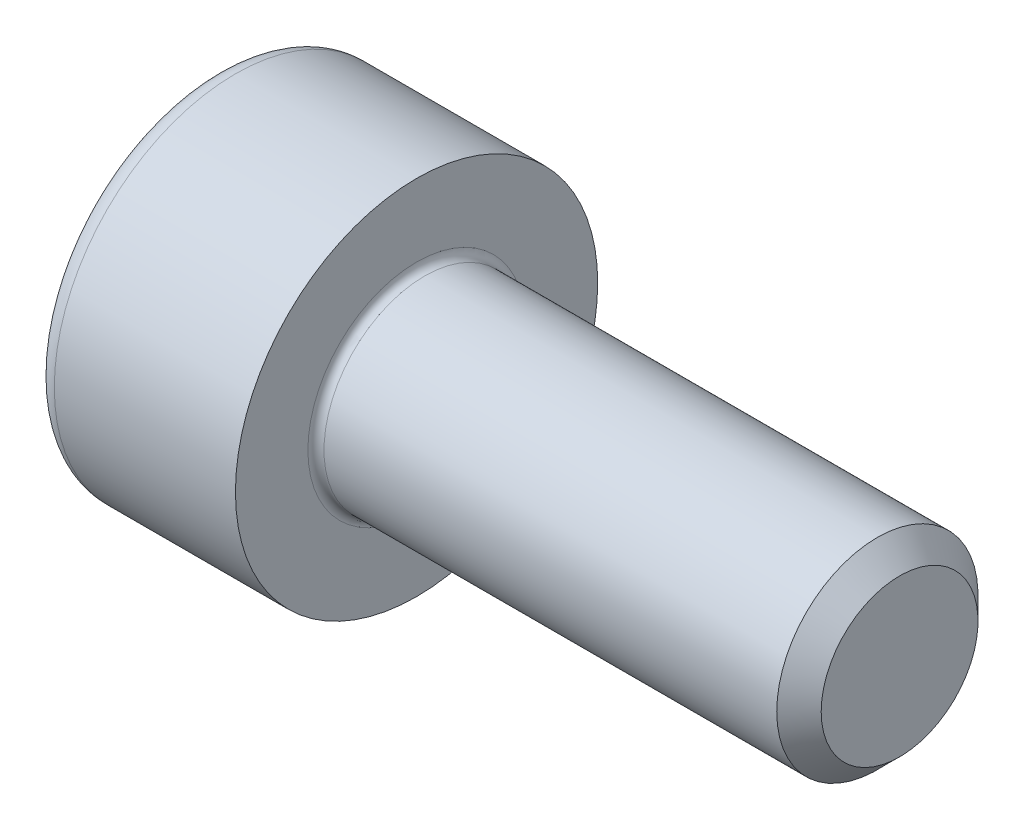
ISO-10303-21;
HEADER;
FILE_DESCRIPTION(('STEP AP214'),'2;1');
FILE_NAME('part.step','',(''),(''),'','','');
FILE_SCHEMA(('AUTOMOTIVE_DESIGN { 1 0 10303 214 1 1 1 1 }'));
ENDSEC;
DATA;
#1=APPLICATION_CONTEXT('core data for automotive mechanical design processes');
#2=APPLICATION_PROTOCOL_DEFINITION('international standard','automotive_design',2000,#1);
#3=PRODUCT_CONTEXT('',#1,'mechanical');
#4=PRODUCT('Part','Part','',(#3));
#5=PRODUCT_RELATED_PRODUCT_CATEGORY('part','',(#4));
#6=PRODUCT_DEFINITION_FORMATION('','',#4);
#7=PRODUCT_DEFINITION_CONTEXT('part definition',#1,'design');
#8=PRODUCT_DEFINITION('design','',#6,#7);
#9=PRODUCT_DEFINITION_SHAPE('','',#8);
#10=(LENGTH_UNIT() NAMED_UNIT(*) SI_UNIT(.MILLI.,.METRE.));
#11=(NAMED_UNIT(*) PLANE_ANGLE_UNIT() SI_UNIT($,.RADIAN.));
#12=(NAMED_UNIT(*) SI_UNIT($,.STERADIAN.) SOLID_ANGLE_UNIT());
#13=UNCERTAINTY_MEASURE_WITH_UNIT(LENGTH_MEASURE(1.E-05),#10,'distance_accuracy_value','');
#14=(GEOMETRIC_REPRESENTATION_CONTEXT(3) GLOBAL_UNCERTAINTY_ASSIGNED_CONTEXT((#13)) GLOBAL_UNIT_ASSIGNED_CONTEXT((#10,
#11,#12)) REPRESENTATION_CONTEXT('',''));
#15=CARTESIAN_POINT('',(0.,0.,0.));
#16=DIRECTION('',(0.,0.,1.));
#17=DIRECTION('',(1.,0.,0.));
#18=AXIS2_PLACEMENT_3D('',#15,#16,#17);
#19=CARTESIAN_POINT('',(-1.40399999992269,0.,0.));
#20=DIRECTION('',(-1.,0.,0.));
#21=DIRECTION('',(0.,0.,1.));
#22=AXIS2_PLACEMENT_3D('',#19,#20,#21);
#23=CONICAL_SURFACE('',#22,1.16162874138581,1.04719755102068);
#24=CARTESIAN_POINT('',(-0.733333333300834,-1.13686837721616E-10,0.));
#25=VERTEX_POINT('',#24);
#26=VERTEX_LOOP('',#25);
#27=FACE_BOUND('',#26,.T.);
#28=CARTESIAN_POINT('',(-1.40000000004636,1.,0.577350269176239));
#29=CARTESIAN_POINT('',(-1.38534777260353,1.,0.526608173631617));
#30=CARTESIAN_POINT('',(-1.3720223385847,1.,0.475428073039767));
#31=CARTESIAN_POINT('',(-1.34876319372511,1.,0.372181722648916));
#32=CARTESIAN_POINT('',(-1.33883771019004,1.,0.320113638959241));
#33=CARTESIAN_POINT('',(-1.3233879794885,1.,0.216622725240409));
#34=CARTESIAN_POINT('',(-1.31776089381223,1.,0.165215814154328));
#35=CARTESIAN_POINT('',(-1.31104458407795,1.,0.0621602316776418));
#36=CARTESIAN_POINT('',(-1.30994979700044,0.999999999999999,0.0105119346090386));
#37=CARTESIAN_POINT('',(-1.31223314509385,0.999999999999999,-0.085987367761552));
#38=CARTESIAN_POINT('',(-1.31505064262633,0.999999999999999,-0.130852853570059));
#39=CARTESIAN_POINT('',(-1.32397865038136,0.999999999999999,-0.220291541181625));
#40=CARTESIAN_POINT('',(-1.33009220740897,0.999999999999999,-0.264864433871037));
#41=CARTESIAN_POINT('',(-1.34537491669912,0.999999999999999,-0.354487373613871));
#42=CARTESIAN_POINT('',(-1.35460882114213,0.999999999999999,-0.399526083396908));
#43=CARTESIAN_POINT('',(-1.37556588045909,0.999999999999999,-0.488931944893052));
#44=CARTESIAN_POINT('',(-1.38728411441893,0.999999999999999,-0.533300241115023));
#45=CARTESIAN_POINT('',(-1.40000000004636,0.999999999999999,-0.577350269176243));
#46=B_SPLINE_CURVE_WITH_KNOTS('',3,(#28,#29,#30,#31,#32,#33,#34,#35,#36,#37,#38,#39,#40,#41,#42,
#43,#44,#45),.UNSPECIFIED.,.F.,.F.,(4,2,2,2,2,2,2,2,4),(0.,0.158508005788217,0.317396908533512,
0.472353803103194,0.627120444482222,0.761853891336563,0.896712096905205,1.0345608112415,
1.17213898674362),.UNSPECIFIED.);
#47=CARTESIAN_POINT('',(-1.40000000004636,0.999999999994205,0.577350269186277));
#48=VERTEX_POINT('',#47);
#49=CARTESIAN_POINT('',(-1.40000000004829,0.999999999999999,-0.577350269182935));
#50=VERTEX_POINT('',#49);
#51=EDGE_CURVE('E21',#48,#50,#46,.T.);
#52=ORIENTED_EDGE('',*,*,#51,.T.);
#53=CARTESIAN_POINT('',(-1.40000000004636,0.999999999988407,-0.577350269196318));
#54=CARTESIAN_POINT('',(-1.38534777260353,0.956056056205507,-0.60272131696863));
#55=CARTESIAN_POINT('',(-1.3720223385847,0.911732788924722,-0.628311367264555));
#56=CARTESIAN_POINT('',(-1.34876319372511,0.822318826638216,-0.67993454245998));
#57=CARTESIAN_POINT('',(-1.33883771019004,0.777226543436584,-0.705968584304817));
#58=CARTESIAN_POINT('',(-1.3233879794885,0.687600783095211,-0.757714041164234));
#59=CARTESIAN_POINT('',(-1.31776089381223,0.643081092164577,-0.783417496707274));
#60=CARTESIAN_POINT('',(-1.31104458407795,0.553832339737964,-0.834945287945617));
#61=CARTESIAN_POINT('',(-1.30994979700044,0.509103602414349,-0.860769436479919));
#62=CARTESIAN_POINT('',(-1.31223314509385,0.425532755113941,-0.909019087665214));
#63=CARTESIAN_POINT('',(-1.31505064262633,0.386678104650645,-0.931451830569467));
#64=CARTESIAN_POINT('',(-1.32397865038136,0.309221929097888,-0.97617117437525));
#65=CARTESIAN_POINT('',(-1.33009220740897,0.2706206717087,-0.998457620719956));
#66=CARTESIAN_POINT('',(-1.34537491669912,0.193004929129563,-1.04326909059137));
#67=CARTESIAN_POINT('',(-1.35460882114213,0.154000262303778,-1.06578844548289));
#68=CARTESIAN_POINT('',(-1.37556588045909,0.0765725150008851,-1.11049137623096));
#69=CARTESIAN_POINT('',(-1.38728411441893,0.0381484433500253,-1.13267552434195));
#70=CARTESIAN_POINT('',(-1.40000000004636,1.1590841575672E-11,-1.15470053837256));
#71=B_SPLINE_CURVE_WITH_KNOTS('',3,(#53,#54,#55,#56,#57,#58,#59,#60,#61,#62,#63,#64,#65,#66,#67,
#68,#69,#70),.UNSPECIFIED.,.F.,.F.,(4,2,2,2,2,2,2,2,4),(0.,0.158508005788217,0.317396908533512,
0.472353803103194,0.627120444482222,0.761853891336563,0.896712096905205,1.03456081124149,
1.17213898674362),.UNSPECIFIED.);
#72=CARTESIAN_POINT('',(-1.40000000004636,0.,-1.15470053837256));
#73=VERTEX_POINT('',#72);
#74=EDGE_CURVE('E81',#50,#73,#71,.T.);
#75=ORIENTED_EDGE('',*,*,#74,.T.);
#76=CARTESIAN_POINT('',(-1.40000000004636,-1.15903822349684E-11,-1.15470053837256));
#77=CARTESIAN_POINT('',(-1.38534777260353,-0.0439439437944907,-1.12932949060025));
#78=CARTESIAN_POINT('',(-1.3720223385847,-0.0882672110752756,-1.10373944030432));
#79=CARTESIAN_POINT('',(-1.34876319372511,-0.177681173361782,-1.0521162651089));
#80=CARTESIAN_POINT('',(-1.33883771019004,-0.222773456563414,-1.02608222326406));
#81=CARTESIAN_POINT('',(-1.3233879794885,-0.312399216904787,-0.974336766404643));
#82=CARTESIAN_POINT('',(-1.31776089381223,-0.356918907835421,-0.948633310861603));
#83=CARTESIAN_POINT('',(-1.31104458407795,-0.446167660262033,-0.897105519623259));
#84=CARTESIAN_POINT('',(-1.30994979700044,-0.490896397585649,-0.871281371088958));
#85=CARTESIAN_POINT('',(-1.31223314509385,-0.574467244886056,-0.823031719903663));
#86=CARTESIAN_POINT('',(-1.31505064262633,-0.613321895349353,-0.800598976999409));
#87=CARTESIAN_POINT('',(-1.32397865038136,-0.69077807090211,-0.755879633193626));
#88=CARTESIAN_POINT('',(-1.33009220740896,-0.729379328291299,-0.73359318684892));
#89=CARTESIAN_POINT('',(-1.34537491669912,-0.806995070870435,-0.688781716977503));
#90=CARTESIAN_POINT('',(-1.35460882114213,-0.845999737696221,-0.666262362085984));
#91=CARTESIAN_POINT('',(-1.37556588045909,-0.923427484999114,-0.621559431337912));
#92=CARTESIAN_POINT('',(-1.38728411441893,-0.961851556649974,-0.599375283226926));
#93=CARTESIAN_POINT('',(-1.40000000004636,-0.999999999988409,-0.577350269196316));
#94=B_SPLINE_CURVE_WITH_KNOTS('',3,(#76,#77,#78,#79,#80,#81,#82,#83,#84,#85,#86,#87,#88,#89,#90,
#91,#92,#93),.UNSPECIFIED.,.F.,.F.,(4,2,2,2,2,2,2,2,4),(0.,0.158508005788217,0.317396908533512,
0.472353803103194,0.627120444482222,0.761853891336564,0.896712096905206,1.0345608112415,
1.17213898674362),.UNSPECIFIED.);
#95=CARTESIAN_POINT('',(-1.40000000004636,-0.999999999994204,-0.577350269186278));
#96=VERTEX_POINT('',#95);
#97=EDGE_CURVE('E106',#73,#96,#94,.T.);
#98=ORIENTED_EDGE('',*,*,#97,.T.);
#99=CARTESIAN_POINT('',(-1.40000000004636,-1.,-0.577350269176241));
#100=CARTESIAN_POINT('',(-1.38534777260353,-1.,-0.526608173631618));
#101=CARTESIAN_POINT('',(-1.3720223385847,-1.,-0.475428073039768));
#102=CARTESIAN_POINT('',(-1.34876319372511,-1.,-0.372181722648918));
#103=CARTESIAN_POINT('',(-1.33883771019004,-1.,-0.320113638959243));
#104=CARTESIAN_POINT('',(-1.3233879794885,-1.,-0.21662272524041));
#105=CARTESIAN_POINT('',(-1.31776089381223,-1.,-0.165215814154329));
#106=CARTESIAN_POINT('',(-1.31104458407795,-1.,-0.0621602316776431));
#107=CARTESIAN_POINT('',(-1.30994979700045,-1.,-0.0105119346090399));
#108=CARTESIAN_POINT('',(-1.31223314509385,-1.,0.0859873677615507));
#109=CARTESIAN_POINT('',(-1.31505064262633,-1.,0.130852853570057));
#110=CARTESIAN_POINT('',(-1.32397865038136,-1.,0.220291541181623));
#111=CARTESIAN_POINT('',(-1.33009220740897,-1.,0.264864433871035));
#112=CARTESIAN_POINT('',(-1.34537491669912,-1.,0.35448737361387));
#113=CARTESIAN_POINT('',(-1.35460882114213,-1.,0.399526083396907));
#114=CARTESIAN_POINT('',(-1.37556588045909,-1.,0.488931944893051));
#115=CARTESIAN_POINT('',(-1.38728411441893,-1.,0.533300241115022));
#116=CARTESIAN_POINT('',(-1.40000000004636,-1.,0.577350269176242));
#117=B_SPLINE_CURVE_WITH_KNOTS('',3,(#99,#100,#101,#102,#103,#104,#105,#106,#107,#108,#109,#110,
#111,#112,#113,#114,#115,#116),.UNSPECIFIED.,.F.,.F.,(4,2,2,2,2,2,2,2,4),(0.,0.158508005788217,
0.317396908533512,0.472353803103194,0.627120444482222,0.761853891336564,0.896712096905206,
1.0345608112415,1.17213898674362),.UNSPECIFIED.);
#118=CARTESIAN_POINT('',(-1.40000000004636,-0.999999999994205,0.57735026918628));
#119=VERTEX_POINT('',#118);
#120=EDGE_CURVE('E130',#96,#119,#117,.T.);
#121=ORIENTED_EDGE('',*,*,#120,.T.);
#122=CARTESIAN_POINT('',(-1.40000000004636,-0.999999999988409,0.577350269196318));
#123=CARTESIAN_POINT('',(-1.38534777260353,-0.956056056205509,0.602721316968629));
#124=CARTESIAN_POINT('',(-1.3720223385847,-0.911732788924724,0.628311367264554));
#125=CARTESIAN_POINT('',(-1.34876319372512,-0.822318826638218,0.67993454245998));
#126=CARTESIAN_POINT('',(-1.33883771019004,-0.777226543436585,0.705968584304817));
#127=CARTESIAN_POINT('',(-1.3233879794885,-0.687600783095212,0.757714041164233));
#128=CARTESIAN_POINT('',(-1.31776089381223,-0.643081092164578,0.783417496707274));
#129=CARTESIAN_POINT('',(-1.31104458407795,-0.553832339737966,0.834945287945617));
#130=CARTESIAN_POINT('',(-1.30994979700045,-0.50910360241435,0.860769436479919));
#131=CARTESIAN_POINT('',(-1.31223314509385,-0.425532755113943,0.909019087665214));
#132=CARTESIAN_POINT('',(-1.31505064262633,-0.386678104650646,0.931451830569467));
#133=CARTESIAN_POINT('',(-1.32397865038136,-0.309221929097889,0.97617117437525));
#134=CARTESIAN_POINT('',(-1.33009220740897,-0.270620671708701,0.998457620719956));
#135=CARTESIAN_POINT('',(-1.34537491669912,-0.193004929129564,1.04326909059137));
#136=CARTESIAN_POINT('',(-1.35460882114213,-0.154000262303779,1.06578844548289));
#137=CARTESIAN_POINT('',(-1.37556588045909,-0.0765725150008856,1.11049137623096));
#138=CARTESIAN_POINT('',(-1.38728411441893,-0.0381484433500257,1.13267552434195));
#139=CARTESIAN_POINT('',(-1.40000000004636,-1.15914119388896E-11,1.15470053837256));
#140=B_SPLINE_CURVE_WITH_KNOTS('',3,(#122,#123,#124,#125,#126,#127,#128,#129,#130,#131,#132,
#133,#134,#135,#136,#137,#138,#139),.UNSPECIFIED.,.F.,.F.,(4,2,2,2,2,2,2,2,4),(0.,
0.158508005788217,0.317396908533513,0.472353803103195,0.627120444482223,0.761853891336564,
0.896712096905206,1.0345608112415,1.17213898674362),.UNSPECIFIED.);
#141=CARTESIAN_POINT('',(-1.40000000004636,0.,1.15470053837256));
#142=VERTEX_POINT('',#141);
#143=EDGE_CURVE('E138',#119,#142,#140,.T.);
#144=ORIENTED_EDGE('',*,*,#143,.T.);
#145=CARTESIAN_POINT('',(-1.40000000004636,1.15900007348579E-11,1.15470053837256));
#146=CARTESIAN_POINT('',(-1.38534777260353,0.0439439437944902,1.12932949060025));
#147=CARTESIAN_POINT('',(-1.3720223385847,0.0882672110752751,1.10373944030432));
#148=CARTESIAN_POINT('',(-1.34876319372511,0.177681173361781,1.0521162651089));
#149=CARTESIAN_POINT('',(-1.33883771019004,0.222773456563413,1.02608222326406));
#150=CARTESIAN_POINT('',(-1.3233879794885,0.312399216904786,0.974336766404643));
#151=CARTESIAN_POINT('',(-1.31776089381223,0.35691890783542,0.948633310861602));
#152=CARTESIAN_POINT('',(-1.31104458407795,0.446167660262032,0.897105519623259));
#153=CARTESIAN_POINT('',(-1.30994979700044,0.490896397585648,0.871281371088958));
#154=CARTESIAN_POINT('',(-1.31223314509385,0.574467244886055,0.823031719903662));
#155=CARTESIAN_POINT('',(-1.31505064262633,0.613321895349353,0.800598976999409));
#156=CARTESIAN_POINT('',(-1.32397865038136,0.69077807090211,0.755879633193625));
#157=CARTESIAN_POINT('',(-1.33009220740896,0.729379328291298,0.733593186848919));
#158=CARTESIAN_POINT('',(-1.34537491669912,0.806995070870435,0.688781716977502));
#159=CARTESIAN_POINT('',(-1.35460882114213,0.845999737696221,0.666262362085983));
#160=CARTESIAN_POINT('',(-1.37556588045909,0.923427484999114,0.621559431337911));
#161=CARTESIAN_POINT('',(-1.38728411441893,0.961851556649975,0.599375283226925));
#162=CARTESIAN_POINT('',(-1.40000000004636,0.999999999988409,0.577350269196314));
#163=B_SPLINE_CURVE_WITH_KNOTS('',3,(#145,#146,#147,#148,#149,#150,#151,#152,#153,#154,#155,
#156,#157,#158,#159,#160,#161,#162),.UNSPECIFIED.,.F.,.F.,(4,2,2,2,2,2,2,2,4),(0.,
0.158508005788217,0.317396908533512,0.472353803103194,0.627120444482222,0.761853891336564,
0.896712096905206,1.0345608112415,1.17213898674362),.UNSPECIFIED.);
#164=EDGE_CURVE('E83',#142,#48,#163,.T.);
#165=ORIENTED_EDGE('',*,*,#164,.T.);
#166=EDGE_LOOP('',(#52,#75,#98,#121,#144,#165));
#167=FACE_BOUND('',#166,.T.);
#168=ADVANCED_FACE('F17',(#27,#167),#23,.F.);
#169=CARTESIAN_POINT('',(-2.5,1.,0.577350269189624));
#170=DIRECTION('',(0.,1.,0.));
#171=DIRECTION('',(0.,0.,1.));
#172=AXIS2_PLACEMENT_3D('',#169,#170,#171);
#173=PLANE('',#172);
#174=DIRECTION('',(1.,0.,0.));
#175=VECTOR('',#174,1.);
#176=CARTESIAN_POINT('',(-2.5,1.,0.577350269189623));
#177=LINE('',#176,#175);
#178=CARTESIAN_POINT('',(-2.5,0.999999999999999,0.577350269189624));
#179=VERTEX_POINT('',#178);
#180=EDGE_CURVE('E85',#48,#179,#177,.F.);
#181=ORIENTED_EDGE('',*,*,#180,.T.);
#182=DIRECTION('',(0.,0.,1.));
#183=VECTOR('',#182,1.);
#184=CARTESIAN_POINT('',(-2.5,0.999999999999999,0.));
#185=LINE('',#184,#183);
#186=CARTESIAN_POINT('',(-2.5,0.999999999999999,-0.577350269189626));
#187=VERTEX_POINT('',#186);
#188=EDGE_CURVE('E90',#187,#179,#185,.T.);
#189=ORIENTED_EDGE('',*,*,#188,.F.);
#190=DIRECTION('',(1.,0.,0.));
#191=VECTOR('',#190,1.);
#192=CARTESIAN_POINT('',(-2.5,0.999999999999999,-0.577350269189626));
#193=LINE('',#192,#191);
#194=EDGE_CURVE('E88',#187,#50,#193,.T.);
#195=ORIENTED_EDGE('',*,*,#194,.T.);
#196=ORIENTED_EDGE('',*,*,#51,.F.);
#197=EDGE_LOOP('',(#181,#189,#195,#196));
#198=FACE_BOUND('',#197,.T.);
#199=ADVANCED_FACE('F77',(#198),#173,.F.);
#200=CARTESIAN_POINT('',(-2.5,0.,1.15470053837925));
#201=DIRECTION('',(0.,0.500000000000001,0.866025403784438));
#202=DIRECTION('',(0.,-0.866025403784438,0.500000000000001));
#203=AXIS2_PLACEMENT_3D('',#200,#201,#202);
#204=PLANE('',#203);
#205=DIRECTION('',(1.,0.,0.));
#206=VECTOR('',#205,1.);
#207=CARTESIAN_POINT('',(-2.5,0.,1.15470053837925));
#208=LINE('',#207,#206);
#209=CARTESIAN_POINT('',(-2.5,0.,1.15470053837925));
#210=VERTEX_POINT('',#209);
#211=EDGE_CURVE('E142',#142,#210,#208,.F.);
#212=ORIENTED_EDGE('',*,*,#211,.T.);
#213=DIRECTION('',(0.,-0.866025403784439,0.5));
#214=VECTOR('',#213,1.);
#215=CARTESIAN_POINT('',(-2.5,1.,0.577350269189624));
#216=LINE('',#215,#214);
#217=EDGE_CURVE('E96',#179,#210,#216,.T.);
#218=ORIENTED_EDGE('',*,*,#217,.F.);
#219=ORIENTED_EDGE('',*,*,#180,.F.);
#220=ORIENTED_EDGE('',*,*,#164,.F.);
#221=EDGE_LOOP('',(#212,#218,#219,#220));
#222=FACE_BOUND('',#221,.T.);
#223=ADVANCED_FACE('F146',(#222),#204,.F.);
#224=CARTESIAN_POINT('',(-2.5,-1.,0.577350269189626));
#225=DIRECTION('',(0.,-0.5,0.866025403784439));
#226=DIRECTION('',(0.,-0.866025403784439,-0.5));
#227=AXIS2_PLACEMENT_3D('',#224,#225,#226);
#228=PLANE('',#227);
#229=DIRECTION('',(1.,0.,0.));
#230=VECTOR('',#229,1.);
#231=CARTESIAN_POINT('',(-2.5,-1.,0.577350269189626));
#232=LINE('',#231,#230);
#233=CARTESIAN_POINT('',(-2.5,-1.,0.577350269189626));
#234=VERTEX_POINT('',#233);
#235=EDGE_CURVE('E137',#119,#234,#232,.F.);
#236=ORIENTED_EDGE('',*,*,#235,.T.);
#237=DIRECTION('',(0.,-0.866025403784439,-0.499999999999999));
#238=VECTOR('',#237,1.);
#239=CARTESIAN_POINT('',(-2.5,0.,1.15470053837925));
#240=LINE('',#239,#238);
#241=EDGE_CURVE('E265',#210,#234,#240,.T.);
#242=ORIENTED_EDGE('',*,*,#241,.F.);
#243=ORIENTED_EDGE('',*,*,#211,.F.);
#244=ORIENTED_EDGE('',*,*,#143,.F.);
#245=EDGE_LOOP('',(#236,#242,#243,#244));
#246=FACE_BOUND('',#245,.T.);
#247=ADVANCED_FACE('F126',(#246),#228,.F.);
#248=CARTESIAN_POINT('',(-2.5,-1.,-0.577350269189625));
#249=DIRECTION('',(0.,-1.,0.));
#250=DIRECTION('',(1.,0.,0.));
#251=AXIS2_PLACEMENT_3D('',#248,#249,#250);
#252=PLANE('',#251);
#253=DIRECTION('',(1.,0.,0.));
#254=VECTOR('',#253,1.);
#255=CARTESIAN_POINT('',(-2.5,-1.,-0.577350269189624));
#256=LINE('',#255,#254);
#257=CARTESIAN_POINT('',(-2.5,-1.,-0.577350269189624));
#258=VERTEX_POINT('',#257);
#259=EDGE_CURVE('E136',#96,#258,#256,.F.);
#260=ORIENTED_EDGE('',*,*,#259,.T.);
#261=DIRECTION('',(0.,0.,1.));
#262=VECTOR('',#261,1.);
#263=CARTESIAN_POINT('',(-2.5,-1.,0.));
#264=LINE('',#263,#262);
#265=EDGE_CURVE('E260',#234,#258,#264,.F.);
#266=ORIENTED_EDGE('',*,*,#265,.F.);
#267=ORIENTED_EDGE('',*,*,#235,.F.);
#268=ORIENTED_EDGE('',*,*,#120,.F.);
#269=EDGE_LOOP('',(#260,#266,#267,#268));
#270=FACE_BOUND('',#269,.T.);
#271=ADVANCED_FACE('F122',(#270),#252,.F.);
#272=CARTESIAN_POINT('',(-2.5,0.,-1.15470053837925));
#273=DIRECTION('',(0.,-0.5,-0.866025403784438));
#274=DIRECTION('',(0.,0.866025403784438,-0.5));
#275=AXIS2_PLACEMENT_3D('',#272,#273,#274);
#276=PLANE('',#275);
#277=DIRECTION('',(1.,0.,0.));
#278=VECTOR('',#277,1.);
#279=CARTESIAN_POINT('',(-2.5,0.,-1.15470053837925));
#280=LINE('',#279,#278);
#281=CARTESIAN_POINT('',(-2.5,0.,-1.15470053837925));
#282=VERTEX_POINT('',#281);
#283=EDGE_CURVE('E39',#73,#282,#280,.F.);
#284=ORIENTED_EDGE('',*,*,#283,.T.);
#285=DIRECTION('',(0.,0.866025403784439,-0.5));
#286=VECTOR('',#285,1.);
#287=CARTESIAN_POINT('',(-2.5,-1.,-0.577350269189625));
#288=LINE('',#287,#286);
#289=EDGE_CURVE('E255',#258,#282,#288,.T.);
#290=ORIENTED_EDGE('',*,*,#289,.F.);
#291=ORIENTED_EDGE('',*,*,#259,.F.);
#292=ORIENTED_EDGE('',*,*,#97,.F.);
#293=EDGE_LOOP('',(#284,#290,#291,#292));
#294=FACE_BOUND('',#293,.T.);
#295=ADVANCED_FACE('F116',(#294),#276,.F.);
#296=CARTESIAN_POINT('',(-2.5,0.999999999999999,-0.577350269189626));
#297=DIRECTION('',(0.,0.5,-0.866025403784439));
#298=DIRECTION('',(0.,0.866025403784439,0.5));
#299=AXIS2_PLACEMENT_3D('',#296,#297,#298);
#300=PLANE('',#299);
#301=ORIENTED_EDGE('',*,*,#194,.F.);
#302=DIRECTION('',(0.,0.866025403784439,0.499999999999999));
#303=VECTOR('',#302,1.);
#304=CARTESIAN_POINT('',(-2.5,0.,-1.15470053837925));
#305=LINE('',#304,#303);
#306=EDGE_CURVE('E253',#282,#187,#305,.T.);
#307=ORIENTED_EDGE('',*,*,#306,.F.);
#308=ORIENTED_EDGE('',*,*,#283,.F.);
#309=ORIENTED_EDGE('',*,*,#74,.F.);
#310=EDGE_LOOP('',(#301,#307,#308,#309));
#311=FACE_BOUND('',#310,.T.);
#312=ADVANCED_FACE('F94',(#311),#300,.F.);
#313=CARTESIAN_POINT('',(-2.5,1.70235026918963,0.));
#314=DIRECTION('',(-1.,0.,0.));
#315=DIRECTION('',(0.,-1.,0.));
#316=AXIS2_PLACEMENT_3D('',#313,#314,#315);
#317=PLANE('',#316);
#318=ORIENTED_EDGE('',*,*,#289,.T.);
#319=ORIENTED_EDGE('',*,*,#306,.T.);
#320=ORIENTED_EDGE('',*,*,#188,.T.);
#321=ORIENTED_EDGE('',*,*,#217,.T.);
#322=ORIENTED_EDGE('',*,*,#241,.T.);
#323=ORIENTED_EDGE('',*,*,#265,.T.);
#324=EDGE_LOOP('',(#318,#319,#320,#321,#322,#323));
#325=FACE_BOUND('',#324,.T.);
#326=CARTESIAN_POINT('',(-2.5,0.,0.));
#327=DIRECTION('',(1.,0.,0.));
#328=DIRECTION('',(0.,1.,0.));
#329=AXIS2_PLACEMENT_3D('',#326,#327,#328);
#330=CIRCLE('',#329,2.);
#331=CARTESIAN_POINT('',(-2.5,2.,0.));
#332=VERTEX_POINT('',#331);
#333=EDGE_CURVE('E216',#332,#332,#330,.T.);
#334=ORIENTED_EDGE('',*,*,#333,.F.);
#335=EDGE_LOOP('',(#334));
#336=FACE_BOUND('',#335,.T.);
#337=ADVANCED_FACE('F115',(#325,#336),#317,.T.);
#338=CARTESIAN_POINT('',(-2.25,0.,0.));
#339=DIRECTION('',(1.,0.,0.));
#340=DIRECTION('',(0.,0.,-1.));
#341=AXIS2_PLACEMENT_3D('',#338,#339,#340);
#342=TOROIDAL_SURFACE('',#341,2.,0.25);
#343=CARTESIAN_POINT('',(-2.25,0.,0.));
#344=DIRECTION('',(1.,0.,0.));
#345=DIRECTION('',(0.,1.,0.));
#346=AXIS2_PLACEMENT_3D('',#343,#344,#345);
#347=CIRCLE('',#346,2.25);
#348=CARTESIAN_POINT('',(-2.25,2.25,0.));
#349=VERTEX_POINT('',#348);
#350=EDGE_CURVE('E280',#349,#349,#347,.T.);
#351=ORIENTED_EDGE('',*,*,#350,.F.);
#352=EDGE_LOOP('',(#351));
#353=FACE_BOUND('',#352,.T.);
#354=ORIENTED_EDGE('',*,*,#333,.T.);
#355=EDGE_LOOP('',(#354));
#356=FACE_BOUND('',#355,.T.);
#357=ADVANCED_FACE('F200',(#353,#356),#342,.T.);
#358=CARTESIAN_POINT('',(-1.25,0.,0.));
#359=DIRECTION('',(1.,0.,0.));
#360=DIRECTION('',(0.,1.,0.));
#361=AXIS2_PLACEMENT_3D('',#358,#359,#360);
#362=CYLINDRICAL_SURFACE('',#361,2.25);
#363=ORIENTED_EDGE('',*,*,#350,.T.);
#364=EDGE_LOOP('',(#363));
#365=FACE_BOUND('',#364,.T.);
#366=CARTESIAN_POINT('',(0.,0.,0.));
#367=DIRECTION('',(1.,0.,0.));
#368=DIRECTION('',(0.,1.,0.));
#369=AXIS2_PLACEMENT_3D('',#366,#367,#368);
#370=CIRCLE('',#369,2.25);
#371=CARTESIAN_POINT('',(0.,2.25,0.));
#372=VERTEX_POINT('',#371);
#373=EDGE_CURVE('E104',#372,#372,#370,.T.);
#374=ORIENTED_EDGE('',*,*,#373,.F.);
#375=EDGE_LOOP('',(#374));
#376=FACE_BOUND('',#375,.T.);
#377=ADVANCED_FACE('F197',(#365,#376),#362,.T.);
#378=CARTESIAN_POINT('',(6.00000000000001,0.624999999999999,0.));
#379=DIRECTION('',(1.,0.,0.));
#380=DIRECTION('',(0.,1.,0.));
#381=AXIS2_PLACEMENT_3D('',#378,#379,#380);
#382=PLANE('',#381);
#383=CARTESIAN_POINT('',(5.99999999997181,0.,0.));
#384=DIRECTION('',(-1.,0.,0.));
#385=DIRECTION('',(0.,0.,1.));
#386=AXIS2_PLACEMENT_3D('',#383,#384,#385);
#387=CIRCLE('',#386,0.973947499971928);
#388=CARTESIAN_POINT('',(5.99999999997181,0.,0.973947499971928));
#389=VERTEX_POINT('',#388);
#390=EDGE_CURVE('E275',#389,#389,#387,.T.);
#391=ORIENTED_EDGE('',*,*,#390,.F.);
#392=EDGE_LOOP('',(#391));
#393=FACE_BOUND('',#392,.T.);
#394=ADVANCED_FACE('F194',(#393),#382,.T.);
#395=CARTESIAN_POINT('',(0.,1.75,0.));
#396=DIRECTION('',(1.,0.,0.));
#397=DIRECTION('',(0.,1.,0.));
#398=AXIS2_PLACEMENT_3D('',#395,#396,#397);
#399=PLANE('',#398);
#400=CARTESIAN_POINT('',(0.,0.,0.));
#401=DIRECTION('',(1.,0.,0.));
#402=DIRECTION('',(0.,1.,0.));
#403=AXIS2_PLACEMENT_3D('',#400,#401,#402);
#404=CIRCLE('',#403,1.35);
#405=CARTESIAN_POINT('',(0.,1.35,0.));
#406=VERTEX_POINT('',#405);
#407=EDGE_CURVE('E181',#406,#406,#404,.F.);
#408=ORIENTED_EDGE('',*,*,#407,.T.);
#409=EDGE_LOOP('',(#408));
#410=FACE_BOUND('',#409,.T.);
#411=ORIENTED_EDGE('',*,*,#373,.T.);
#412=EDGE_LOOP('',(#411));
#413=FACE_BOUND('',#412,.T.);
#414=ADVANCED_FACE('F185',(#410,#413),#399,.T.);
#415=CARTESIAN_POINT('',(5.72394749997329,0.,0.));
#416=DIRECTION('',(-1.,0.,0.));
#417=DIRECTION('',(0.,0.,1.));
#418=AXIS2_PLACEMENT_3D('',#415,#416,#417);
#419=CONICAL_SURFACE('',#418,1.24999999997044,0.785398163397448);
#420=ORIENTED_EDGE('',*,*,#390,.T.);
#421=EDGE_LOOP('',(#420));
#422=FACE_BOUND('',#421,.T.);
#423=CARTESIAN_POINT('',(5.7239475,0.,0.));
#424=DIRECTION('',(1.,0.,0.));
#425=DIRECTION('',(0.,1.,0.));
#426=AXIS2_PLACEMENT_3D('',#423,#424,#425);
#427=CIRCLE('',#426,1.25);
#428=CARTESIAN_POINT('',(5.7239475,1.25,0.));
#429=VERTEX_POINT('',#428);
#430=EDGE_CURVE('E30',#429,#429,#427,.F.);
#431=ORIENTED_EDGE('',*,*,#430,.F.);
#432=EDGE_LOOP('',(#431));
#433=FACE_BOUND('',#432,.T.);
#434=ADVANCED_FACE('F163',(#422,#433),#419,.T.);
#435=CARTESIAN_POINT('',(0.100000000000002,0.,0.));
#436=DIRECTION('',(1.,0.,0.));
#437=DIRECTION('',(0.,0.,-1.));
#438=AXIS2_PLACEMENT_3D('',#435,#436,#437);
#439=TOROIDAL_SURFACE('',#438,1.35,0.1);
#440=CARTESIAN_POINT('',(0.100000000000002,0.,0.));
#441=DIRECTION('',(1.,0.,0.));
#442=DIRECTION('',(0.,1.,0.));
#443=AXIS2_PLACEMENT_3D('',#440,#441,#442);
#444=CIRCLE('',#443,1.25);
#445=CARTESIAN_POINT('',(0.100000000000002,1.25,0.));
#446=VERTEX_POINT('',#445);
#447=EDGE_CURVE('E11',#446,#446,#444,.T.);
#448=ORIENTED_EDGE('',*,*,#447,.F.);
#449=EDGE_LOOP('',(#448));
#450=FACE_BOUND('',#449,.T.);
#451=ORIENTED_EDGE('',*,*,#407,.F.);
#452=EDGE_LOOP('',(#451));
#453=FACE_BOUND('',#452,.T.);
#454=ADVANCED_FACE('F157',(#450,#453),#439,.F.);
#455=CARTESIAN_POINT('',(3.5625,0.,0.));
#456=DIRECTION('',(1.,0.,0.));
#457=DIRECTION('',(0.,1.,0.));
#458=AXIS2_PLACEMENT_3D('',#455,#456,#457);
#459=CYLINDRICAL_SURFACE('',#458,1.25);
#460=ORIENTED_EDGE('',*,*,#447,.T.);
#461=EDGE_LOOP('',(#460));
#462=FACE_BOUND('',#461,.T.);
#463=ORIENTED_EDGE('',*,*,#430,.T.);
#464=EDGE_LOOP('',(#463));
#465=FACE_BOUND('',#464,.T.);
#466=ADVANCED_FACE('F155',(#462,#465),#459,.T.);
#467=CLOSED_SHELL('',(#168,#199,#223,#247,#271,#295,#312,#337,#357,#377,#394,#414,#434,#454,#466));
#468=MANIFOLD_SOLID_BREP('B1',#467);
#469=ADVANCED_BREP_SHAPE_REPRESENTATION('',(#18,#468),#14);
#470=SHAPE_DEFINITION_REPRESENTATION(#9,#469);
ENDSEC;
END-ISO-10303-21;
